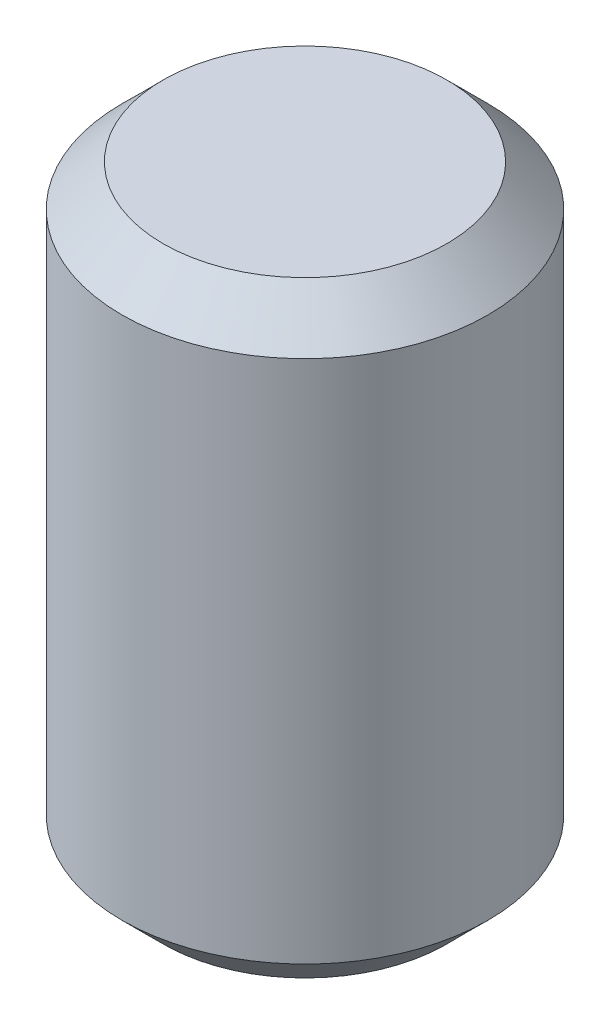
ISO-10303-21;
HEADER;
FILE_DESCRIPTION(('STEP AP214'),'2;1');
FILE_NAME('part.step','',(''),(''),'','','');
FILE_SCHEMA(('AUTOMOTIVE_DESIGN { 1 0 10303 214 1 1 1 1 }'));
ENDSEC;
DATA;
#1=APPLICATION_CONTEXT('core data for automotive mechanical design processes');
#2=APPLICATION_PROTOCOL_DEFINITION('international standard','automotive_design',2000,#1);
#3=PRODUCT_CONTEXT('',#1,'mechanical');
#4=PRODUCT('Part','Part','',(#3));
#5=PRODUCT_RELATED_PRODUCT_CATEGORY('part','',(#4));
#6=PRODUCT_DEFINITION_FORMATION('','',#4);
#7=PRODUCT_DEFINITION_CONTEXT('part definition',#1,'design');
#8=PRODUCT_DEFINITION('design','',#6,#7);
#9=PRODUCT_DEFINITION_SHAPE('','',#8);
#10=(LENGTH_UNIT() NAMED_UNIT(*) SI_UNIT(.MILLI.,.METRE.));
#11=(NAMED_UNIT(*) PLANE_ANGLE_UNIT() SI_UNIT($,.RADIAN.));
#12=(NAMED_UNIT(*) SI_UNIT($,.STERADIAN.) SOLID_ANGLE_UNIT());
#13=UNCERTAINTY_MEASURE_WITH_UNIT(LENGTH_MEASURE(1.E-05),#10,'distance_accuracy_value','');
#14=(GEOMETRIC_REPRESENTATION_CONTEXT(3) GLOBAL_UNCERTAINTY_ASSIGNED_CONTEXT((#13)) GLOBAL_UNIT_ASSIGNED_CONTEXT((#10,
#11,#12)) REPRESENTATION_CONTEXT('',''));
#15=CARTESIAN_POINT('',(0.,0.,0.));
#16=DIRECTION('',(0.,0.,1.));
#17=DIRECTION('',(1.,0.,0.));
#18=AXIS2_PLACEMENT_3D('',#15,#16,#17);
#19=CARTESIAN_POINT('',(0.,0.,0.));
#20=DIRECTION('',(0.,1.,0.));
#21=DIRECTION('',(0.,0.,1.));
#22=AXIS2_PLACEMENT_3D('',#19,#20,#21);
#23=CYLINDRICAL_SURFACE('',#22,0.89);
#24=CARTESIAN_POINT('',(0.,0.199999999989195,0.));
#25=DIRECTION('',(0.,-1.,0.));
#26=DIRECTION('',(0.,0.,-1.));
#27=AXIS2_PLACEMENT_3D('',#24,#25,#26);
#28=CIRCLE('',#27,0.89);
#29=CARTESIAN_POINT('',(0.,0.199999999989195,-0.89));
#30=VERTEX_POINT('',#29);
#31=EDGE_CURVE('E142',#30,#30,#28,.F.);
#32=ORIENTED_EDGE('',*,*,#31,.T.);
#33=EDGE_LOOP('',(#32));
#34=FACE_BOUND('',#33,.T.);
#35=CARTESIAN_POINT('',(0.,2.74999999995396,0.));
#36=DIRECTION('',(0.,1.,0.));
#37=DIRECTION('',(0.,0.,1.));
#38=AXIS2_PLACEMENT_3D('',#35,#36,#37);
#39=CIRCLE('',#38,0.89);
#40=CARTESIAN_POINT('',(0.,2.74999999995396,0.89));
#41=VERTEX_POINT('',#40);
#42=EDGE_CURVE('E134',#41,#41,#39,.F.);
#43=ORIENTED_EDGE('',*,*,#42,.T.);
#44=EDGE_LOOP('',(#43));
#45=FACE_BOUND('',#44,.T.);
#46=ADVANCED_FACE('F32',(#34,#45),#23,.T.);
#47=CARTESIAN_POINT('',(0.89,0.,0.));
#48=DIRECTION('',(0.,-1.,0.));
#49=DIRECTION('',(0.,0.,-1.));
#50=AXIS2_PLACEMENT_3D('',#47,#48,#49);
#51=PLANE('',#50);
#52=CARTESIAN_POINT('',(0.,0.,0.));
#53=DIRECTION('',(0.,-1.,0.));
#54=DIRECTION('',(0.,0.,-1.));
#55=AXIS2_PLACEMENT_3D('',#52,#53,#54);
#56=CIRCLE('',#55,0.68999999995396);
#57=CARTESIAN_POINT('',(0.,0.,-0.68999999995396));
#58=VERTEX_POINT('',#57);
#59=EDGE_CURVE('E40',#58,#58,#56,.T.);
#60=ORIENTED_EDGE('',*,*,#59,.T.);
#61=EDGE_LOOP('',(#60));
#62=FACE_BOUND('',#61,.T.);
#63=DIRECTION('',(-1.,0.,0.));
#64=VECTOR('',#63,1.);
#65=CARTESIAN_POINT('',(0.234999999999993,0.,0.407031939778696));
#66=LINE('',#65,#64);
#67=CARTESIAN_POINT('',(0.234999999999993,0.,0.407031939778696));
#68=VERTEX_POINT('',#67);
#69=CARTESIAN_POINT('',(-0.235,0.,0.4070319397787));
#70=VERTEX_POINT('',#69);
#71=EDGE_CURVE('E47',#68,#70,#66,.T.);
#72=ORIENTED_EDGE('',*,*,#71,.F.);
#73=DIRECTION('',(-0.50000000000001,0.,0.866025403784433));
#74=VECTOR('',#73,1.);
#75=CARTESIAN_POINT('',(0.470000000000007,0.,0.));
#76=LINE('',#75,#74);
#77=CARTESIAN_POINT('',(0.470000000000007,0.,0.));
#78=VERTEX_POINT('',#77);
#79=EDGE_CURVE('E130',#78,#68,#76,.T.);
#80=ORIENTED_EDGE('',*,*,#79,.F.);
#81=DIRECTION('',(0.500000000000002,0.,0.866025403784437));
#82=VECTOR('',#81,1.);
#83=CARTESIAN_POINT('',(0.235,0.,-0.4070319397787));
#84=LINE('',#83,#82);
#85=CARTESIAN_POINT('',(0.235,0.,-0.4070319397787));
#86=VERTEX_POINT('',#85);
#87=EDGE_CURVE('E128',#86,#78,#84,.T.);
#88=ORIENTED_EDGE('',*,*,#87,.F.);
#89=DIRECTION('',(1.,0.,0.));
#90=VECTOR('',#89,1.);
#91=CARTESIAN_POINT('',(-0.234999999999996,0.,-0.407031939778698));
#92=LINE('',#91,#90);
#93=CARTESIAN_POINT('',(-0.234999999999996,0.,-0.407031939778698));
#94=VERTEX_POINT('',#93);
#95=EDGE_CURVE('E95',#94,#86,#92,.T.);
#96=ORIENTED_EDGE('',*,*,#95,.F.);
#97=DIRECTION('',(0.500000000000002,0.,-0.866025403784437));
#98=VECTOR('',#97,1.);
#99=CARTESIAN_POINT('',(-0.470000000000007,0.,0.));
#100=LINE('',#99,#98);
#101=CARTESIAN_POINT('',(-0.470000000000007,0.,0.));
#102=VERTEX_POINT('',#101);
#103=EDGE_CURVE('E124',#102,#94,#100,.T.);
#104=ORIENTED_EDGE('',*,*,#103,.F.);
#105=DIRECTION('',(-0.500000000000002,0.,-0.866025403784437));
#106=VECTOR('',#105,1.);
#107=CARTESIAN_POINT('',(-0.235,0.,0.4070319397787));
#108=LINE('',#107,#106);
#109=EDGE_CURVE('E121',#70,#102,#108,.T.);
#110=ORIENTED_EDGE('',*,*,#109,.F.);
#111=EDGE_LOOP('',(#72,#80,#88,#96,#104,#110));
#112=FACE_BOUND('',#111,.T.);
#113=ADVANCED_FACE('F147',(#62,#112),#51,.T.);
#114=CARTESIAN_POINT('',(0.,2.95,0.));
#115=DIRECTION('',(0.,1.,0.));
#116=DIRECTION('',(0.,0.,1.));
#117=AXIS2_PLACEMENT_3D('',#114,#115,#116);
#118=PLANE('',#117);
#119=CARTESIAN_POINT('',(0.,2.95,0.));
#120=DIRECTION('',(0.,1.,0.));
#121=DIRECTION('',(0.,0.,1.));
#122=AXIS2_PLACEMENT_3D('',#119,#120,#121);
#123=CIRCLE('',#122,0.690000000010805);
#124=CARTESIAN_POINT('',(0.,2.95,0.690000000010805));
#125=VERTEX_POINT('',#124);
#126=EDGE_CURVE('E11',#125,#125,#123,.T.);
#127=ORIENTED_EDGE('',*,*,#126,.T.);
#128=EDGE_LOOP('',(#127));
#129=FACE_BOUND('',#128,.T.);
#130=ADVANCED_FACE('F164',(#129),#118,.T.);
#131=CARTESIAN_POINT('',(0.234999999999993,0.375,0.407031939778696));
#132=DIRECTION('',(0.,0.,1.));
#133=DIRECTION('',(1.,0.,0.));
#134=AXIS2_PLACEMENT_3D('',#131,#132,#133);
#135=PLANE('',#134);
#136=ORIENTED_EDGE('',*,*,#71,.T.);
#137=DIRECTION('',(0.,-1.,0.));
#138=VECTOR('',#137,1.);
#139=CARTESIAN_POINT('',(-0.235,0.375,0.4070319397787));
#140=LINE('',#139,#138);
#141=CARTESIAN_POINT('',(-0.235,0.375,0.4070319397787));
#142=VERTEX_POINT('',#141);
#143=EDGE_CURVE('E77',#142,#70,#140,.T.);
#144=ORIENTED_EDGE('',*,*,#143,.F.);
#145=DIRECTION('',(-1.,0.,0.));
#146=VECTOR('',#145,1.);
#147=CARTESIAN_POINT('',(0.234999999999993,0.375,0.407031939778696));
#148=LINE('',#147,#146);
#149=CARTESIAN_POINT('',(0.234999999999993,0.375,0.407031939778696));
#150=VERTEX_POINT('',#149);
#151=EDGE_CURVE('E132',#150,#142,#148,.T.);
#152=ORIENTED_EDGE('',*,*,#151,.F.);
#153=DIRECTION('',(0.,-1.,0.));
#154=VECTOR('',#153,1.);
#155=CARTESIAN_POINT('',(0.234999999999993,0.375,0.407031939778696));
#156=LINE('',#155,#154);
#157=EDGE_CURVE('E55',#150,#68,#156,.T.);
#158=ORIENTED_EDGE('',*,*,#157,.T.);
#159=EDGE_LOOP('',(#136,#144,#152,#158));
#160=FACE_BOUND('',#159,.T.);
#161=ADVANCED_FACE('F166',(#160),#135,.F.);
#162=CARTESIAN_POINT('',(0.470000000000007,0.375,0.));
#163=DIRECTION('',(0.866025403784433,0.,0.500000000000009));
#164=DIRECTION('',(0.50000000000001,0.,-0.866025403784433));
#165=AXIS2_PLACEMENT_3D('',#162,#163,#164);
#166=PLANE('',#165);
#167=ORIENTED_EDGE('',*,*,#79,.T.);
#168=ORIENTED_EDGE('',*,*,#157,.F.);
#169=DIRECTION('',(-0.50000000000001,0.,0.866025403784433));
#170=VECTOR('',#169,1.);
#171=CARTESIAN_POINT('',(0.470000000000007,0.375,0.));
#172=LINE('',#171,#170);
#173=CARTESIAN_POINT('',(0.470000000000007,0.375,0.));
#174=VERTEX_POINT('',#173);
#175=EDGE_CURVE('E107',#174,#150,#172,.T.);
#176=ORIENTED_EDGE('',*,*,#175,.F.);
#177=DIRECTION('',(0.,-1.,0.));
#178=VECTOR('',#177,1.);
#179=CARTESIAN_POINT('',(0.470000000000007,0.375,0.));
#180=LINE('',#179,#178);
#181=EDGE_CURVE('E99',#174,#78,#180,.T.);
#182=ORIENTED_EDGE('',*,*,#181,.T.);
#183=EDGE_LOOP('',(#167,#168,#176,#182));
#184=FACE_BOUND('',#183,.T.);
#185=ADVANCED_FACE('F172',(#184),#166,.F.);
#186=CARTESIAN_POINT('',(0.235,0.375,-0.4070319397787));
#187=DIRECTION('',(0.866025403784437,0.,-0.500000000000002));
#188=DIRECTION('',(-0.500000000000002,0.,-0.866025403784438));
#189=AXIS2_PLACEMENT_3D('',#186,#187,#188);
#190=PLANE('',#189);
#191=ORIENTED_EDGE('',*,*,#87,.T.);
#192=ORIENTED_EDGE('',*,*,#181,.F.);
#193=DIRECTION('',(0.500000000000002,0.,0.866025403784437));
#194=VECTOR('',#193,1.);
#195=CARTESIAN_POINT('',(0.235,0.375,-0.4070319397787));
#196=LINE('',#195,#194);
#197=CARTESIAN_POINT('',(0.235,0.375,-0.4070319397787));
#198=VERTEX_POINT('',#197);
#199=EDGE_CURVE('E103',#198,#174,#196,.T.);
#200=ORIENTED_EDGE('',*,*,#199,.F.);
#201=DIRECTION('',(0.,-1.,0.));
#202=VECTOR('',#201,1.);
#203=CARTESIAN_POINT('',(0.235,0.375,-0.4070319397787));
#204=LINE('',#203,#202);
#205=EDGE_CURVE('E88',#198,#86,#204,.T.);
#206=ORIENTED_EDGE('',*,*,#205,.T.);
#207=EDGE_LOOP('',(#191,#192,#200,#206));
#208=FACE_BOUND('',#207,.T.);
#209=ADVANCED_FACE('F104',(#208),#190,.F.);
#210=CARTESIAN_POINT('',(-0.234999999999996,0.375,-0.407031939778698));
#211=DIRECTION('',(0.,0.,-1.));
#212=DIRECTION('',(-1.,0.,0.));
#213=AXIS2_PLACEMENT_3D('',#210,#211,#212);
#214=PLANE('',#213);
#215=ORIENTED_EDGE('',*,*,#95,.T.);
#216=ORIENTED_EDGE('',*,*,#205,.F.);
#217=DIRECTION('',(1.,0.,0.));
#218=VECTOR('',#217,1.);
#219=CARTESIAN_POINT('',(-0.234999999999996,0.375,-0.407031939778698));
#220=LINE('',#219,#218);
#221=CARTESIAN_POINT('',(-0.234999999999996,0.375,-0.407031939778698));
#222=VERTEX_POINT('',#221);
#223=EDGE_CURVE('E92',#222,#198,#220,.T.);
#224=ORIENTED_EDGE('',*,*,#223,.F.);
#225=DIRECTION('',(0.,-1.,0.));
#226=VECTOR('',#225,1.);
#227=CARTESIAN_POINT('',(-0.234999999999996,0.375,-0.407031939778698));
#228=LINE('',#227,#226);
#229=EDGE_CURVE('E100',#222,#94,#228,.T.);
#230=ORIENTED_EDGE('',*,*,#229,.T.);
#231=EDGE_LOOP('',(#215,#216,#224,#230));
#232=FACE_BOUND('',#231,.T.);
#233=ADVANCED_FACE('F90',(#232),#214,.F.);
#234=CARTESIAN_POINT('',(-0.470000000000007,0.375,0.));
#235=DIRECTION('',(-0.866025403784437,0.,-0.500000000000002));
#236=DIRECTION('',(-0.500000000000002,0.,0.866025403784438));
#237=AXIS2_PLACEMENT_3D('',#234,#235,#236);
#238=PLANE('',#237);
#239=ORIENTED_EDGE('',*,*,#103,.T.);
#240=ORIENTED_EDGE('',*,*,#229,.F.);
#241=DIRECTION('',(0.500000000000002,0.,-0.866025403784437));
#242=VECTOR('',#241,1.);
#243=CARTESIAN_POINT('',(-0.470000000000007,0.375,0.));
#244=LINE('',#243,#242);
#245=CARTESIAN_POINT('',(-0.470000000000007,0.375,0.));
#246=VERTEX_POINT('',#245);
#247=EDGE_CURVE('E113',#246,#222,#244,.T.);
#248=ORIENTED_EDGE('',*,*,#247,.F.);
#249=DIRECTION('',(0.,-1.,0.));
#250=VECTOR('',#249,1.);
#251=CARTESIAN_POINT('',(-0.470000000000007,0.375,0.));
#252=LINE('',#251,#250);
#253=EDGE_CURVE('E137',#246,#102,#252,.T.);
#254=ORIENTED_EDGE('',*,*,#253,.T.);
#255=EDGE_LOOP('',(#239,#240,#248,#254));
#256=FACE_BOUND('',#255,.T.);
#257=ADVANCED_FACE('F179',(#256),#238,.F.);
#258=CARTESIAN_POINT('',(-0.235,0.375,0.4070319397787));
#259=DIRECTION('',(-0.866025403784437,0.,0.500000000000002));
#260=DIRECTION('',(0.500000000000002,0.,0.866025403784438));
#261=AXIS2_PLACEMENT_3D('',#258,#259,#260);
#262=PLANE('',#261);
#263=ORIENTED_EDGE('',*,*,#109,.T.);
#264=ORIENTED_EDGE('',*,*,#253,.F.);
#265=DIRECTION('',(-0.500000000000002,0.,-0.866025403784437));
#266=VECTOR('',#265,1.);
#267=CARTESIAN_POINT('',(-0.235,0.375,0.4070319397787));
#268=LINE('',#267,#266);
#269=EDGE_CURVE('E115',#142,#246,#268,.T.);
#270=ORIENTED_EDGE('',*,*,#269,.F.);
#271=ORIENTED_EDGE('',*,*,#143,.T.);
#272=EDGE_LOOP('',(#263,#264,#270,#271));
#273=FACE_BOUND('',#272,.T.);
#274=ADVANCED_FACE('F176',(#273),#262,.F.);
#275=CARTESIAN_POINT('',(0.,0.375,0.));
#276=DIRECTION('',(0.,-1.,0.));
#277=DIRECTION('',(0.,0.,-1.));
#278=AXIS2_PLACEMENT_3D('',#275,#276,#277);
#279=PLANE('',#278);
#280=ORIENTED_EDGE('',*,*,#151,.T.);
#281=ORIENTED_EDGE('',*,*,#269,.T.);
#282=ORIENTED_EDGE('',*,*,#247,.T.);
#283=ORIENTED_EDGE('',*,*,#223,.T.);
#284=ORIENTED_EDGE('',*,*,#199,.T.);
#285=ORIENTED_EDGE('',*,*,#175,.T.);
#286=EDGE_LOOP('',(#280,#281,#282,#283,#284,#285));
#287=FACE_BOUND('',#286,.T.);
#288=ADVANCED_FACE('F110',(#287),#279,.T.);
#289=CARTESIAN_POINT('',(0.,0.199999999989195,0.));
#290=DIRECTION('',(0.,1.,0.));
#291=DIRECTION('',(0.,0.,1.));
#292=AXIS2_PLACEMENT_3D('',#289,#290,#291);
#293=CONICAL_SURFACE('',#292,0.89,0.78539816353956);
#294=ORIENTED_EDGE('',*,*,#59,.F.);
#295=EDGE_LOOP('',(#294));
#296=FACE_BOUND('',#295,.T.);
#297=ORIENTED_EDGE('',*,*,#31,.F.);
#298=EDGE_LOOP('',(#297));
#299=FACE_BOUND('',#298,.T.);
#300=ADVANCED_FACE('F150',(#296,#299),#293,.T.);
#301=CARTESIAN_POINT('',(0.,2.95,0.));
#302=DIRECTION('',(0.,-1.,0.));
#303=DIRECTION('',(0.,0.,-1.));
#304=AXIS2_PLACEMENT_3D('',#301,#302,#303);
#305=CONICAL_SURFACE('',#304,0.690000000010805,0.785398163255337);
#306=ORIENTED_EDGE('',*,*,#42,.F.);
#307=EDGE_LOOP('',(#306));
#308=FACE_BOUND('',#307,.T.);
#309=ORIENTED_EDGE('',*,*,#126,.F.);
#310=EDGE_LOOP('',(#309));
#311=FACE_BOUND('',#310,.T.);
#312=ADVANCED_FACE('F34',(#308,#311),#305,.T.);
#313=CLOSED_SHELL('',(#46,#113,#130,#161,#185,#209,#233,#257,#274,#288,#300,#312));
#314=MANIFOLD_SOLID_BREP('B2',#313);
#315=ADVANCED_BREP_SHAPE_REPRESENTATION('',(#18,#314),#14);
#316=SHAPE_DEFINITION_REPRESENTATION(#9,#315);
ENDSEC;
END-ISO-10303-21;
